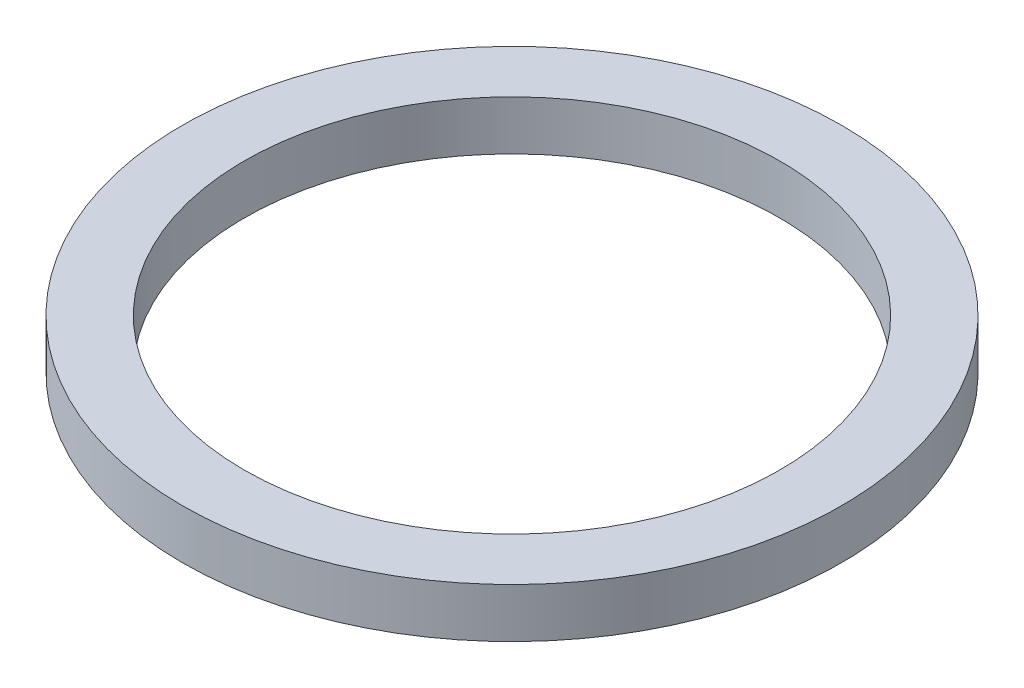
ISO-10303-21;
HEADER;
FILE_DESCRIPTION(('STEP AP214'),'2;1');
FILE_NAME('part.step','',(''),(''),'','','');
FILE_SCHEMA(('AUTOMOTIVE_DESIGN { 1 0 10303 214 1 1 1 1 }'));
ENDSEC;
DATA;
#1=APPLICATION_CONTEXT('core data for automotive mechanical design processes');
#2=APPLICATION_PROTOCOL_DEFINITION('international standard','automotive_design',2000,#1);
#3=PRODUCT_CONTEXT('',#1,'mechanical');
#4=PRODUCT('Part','Part','',(#3));
#5=PRODUCT_RELATED_PRODUCT_CATEGORY('part','',(#4));
#6=PRODUCT_DEFINITION_FORMATION('','',#4);
#7=PRODUCT_DEFINITION_CONTEXT('part definition',#1,'design');
#8=PRODUCT_DEFINITION('design','',#6,#7);
#9=PRODUCT_DEFINITION_SHAPE('','',#8);
#10=(LENGTH_UNIT() NAMED_UNIT(*) SI_UNIT(.MILLI.,.METRE.));
#11=(NAMED_UNIT(*) PLANE_ANGLE_UNIT() SI_UNIT($,.RADIAN.));
#12=(NAMED_UNIT(*) SI_UNIT($,.STERADIAN.) SOLID_ANGLE_UNIT());
#13=UNCERTAINTY_MEASURE_WITH_UNIT(LENGTH_MEASURE(1.E-05),#10,'distance_accuracy_value','');
#14=(GEOMETRIC_REPRESENTATION_CONTEXT(3) GLOBAL_UNCERTAINTY_ASSIGNED_CONTEXT((#13)) GLOBAL_UNIT_ASSIGNED_CONTEXT((#10,
#11,#12)) REPRESENTATION_CONTEXT('',''));
#15=CARTESIAN_POINT('',(0.,0.,0.));
#16=DIRECTION('',(0.,0.,1.));
#17=DIRECTION('',(1.,0.,0.));
#18=AXIS2_PLACEMENT_3D('',#15,#16,#17);
#19=CARTESIAN_POINT('',(0.,6.,0.));
#20=DIRECTION('',(0.,-1.,0.));
#21=DIRECTION('',(0.,0.,-1.));
#22=AXIS2_PLACEMENT_3D('',#19,#20,#21);
#23=CYLINDRICAL_SURFACE('',#22,40.);
#24=CARTESIAN_POINT('',(0.,6.,0.));
#25=DIRECTION('',(0.,1.,0.));
#26=DIRECTION('',(0.,0.,1.));
#27=AXIS2_PLACEMENT_3D('',#24,#25,#26);
#28=CIRCLE('',#27,40.);
#29=CARTESIAN_POINT('',(0.,6.,40.));
#30=VERTEX_POINT('',#29);
#31=EDGE_CURVE('E10',#30,#30,#28,.T.);
#32=ORIENTED_EDGE('',*,*,#31,.F.);
#33=EDGE_LOOP('',(#32));
#34=FACE_BOUND('',#33,.T.);
#35=CARTESIAN_POINT('',(0.,0.,0.));
#36=DIRECTION('',(0.,1.,0.));
#37=DIRECTION('',(0.,0.,1.));
#38=AXIS2_PLACEMENT_3D('',#35,#36,#37);
#39=CIRCLE('',#38,40.);
#40=CARTESIAN_POINT('',(0.,0.,40.));
#41=VERTEX_POINT('',#40);
#42=EDGE_CURVE('E37',#41,#41,#39,.T.);
#43=ORIENTED_EDGE('',*,*,#42,.T.);
#44=EDGE_LOOP('',(#43));
#45=FACE_BOUND('',#44,.T.);
#46=ADVANCED_FACE('F40',(#34,#45),#23,.T.);
#47=CARTESIAN_POINT('',(0.,6.,0.));
#48=DIRECTION('',(0.,1.,0.));
#49=DIRECTION('',(0.,0.,1.));
#50=AXIS2_PLACEMENT_3D('',#47,#48,#49);
#51=PLANE('',#50);
#52=CARTESIAN_POINT('',(0.,6.,0.));
#53=DIRECTION('',(0.,1.,0.));
#54=DIRECTION('',(0.,0.,1.));
#55=AXIS2_PLACEMENT_3D('',#52,#53,#54);
#56=CIRCLE('',#55,32.5);
#57=CARTESIAN_POINT('',(0.,6.,32.5));
#58=VERTEX_POINT('',#57);
#59=EDGE_CURVE('E50',#58,#58,#56,.T.);
#60=ORIENTED_EDGE('',*,*,#59,.F.);
#61=EDGE_LOOP('',(#60));
#62=FACE_BOUND('',#61,.T.);
#63=ORIENTED_EDGE('',*,*,#31,.T.);
#64=EDGE_LOOP('',(#63));
#65=FACE_BOUND('',#64,.T.);
#66=ADVANCED_FACE('F59',(#62,#65),#51,.T.);
#67=CARTESIAN_POINT('',(0.,0.,0.));
#68=DIRECTION('',(0.,1.,0.));
#69=DIRECTION('',(0.,0.,1.));
#70=AXIS2_PLACEMENT_3D('',#67,#68,#69);
#71=PLANE('',#70);
#72=CARTESIAN_POINT('',(0.,0.,0.));
#73=DIRECTION('',(0.,1.,0.));
#74=DIRECTION('',(0.,0.,1.));
#75=AXIS2_PLACEMENT_3D('',#72,#73,#74);
#76=CIRCLE('',#75,32.5);
#77=CARTESIAN_POINT('',(0.,0.,32.5));
#78=VERTEX_POINT('',#77);
#79=EDGE_CURVE('E47',#78,#78,#76,.T.);
#80=ORIENTED_EDGE('',*,*,#79,.T.);
#81=EDGE_LOOP('',(#80));
#82=FACE_BOUND('',#81,.T.);
#83=ORIENTED_EDGE('',*,*,#42,.F.);
#84=EDGE_LOOP('',(#83));
#85=FACE_BOUND('',#84,.T.);
#86=ADVANCED_FACE('F58',(#82,#85),#71,.F.);
#87=CARTESIAN_POINT('',(0.,6.,0.));
#88=DIRECTION('',(0.,-1.,0.));
#89=DIRECTION('',(0.,0.,-1.));
#90=AXIS2_PLACEMENT_3D('',#87,#88,#89);
#91=CYLINDRICAL_SURFACE('',#90,32.5);
#92=ORIENTED_EDGE('',*,*,#59,.T.);
#93=EDGE_LOOP('',(#92));
#94=FACE_BOUND('',#93,.T.);
#95=ORIENTED_EDGE('',*,*,#79,.F.);
#96=EDGE_LOOP('',(#95));
#97=FACE_BOUND('',#96,.T.);
#98=ADVANCED_FACE('F54',(#94,#97),#91,.F.);
#99=CLOSED_SHELL('',(#46,#66,#86,#98));
#100=MANIFOLD_SOLID_BREP('B2',#99);
#101=ADVANCED_BREP_SHAPE_REPRESENTATION('',(#18,#100),#14);
#102=SHAPE_DEFINITION_REPRESENTATION(#9,#101);
ENDSEC;
END-ISO-10303-21;
